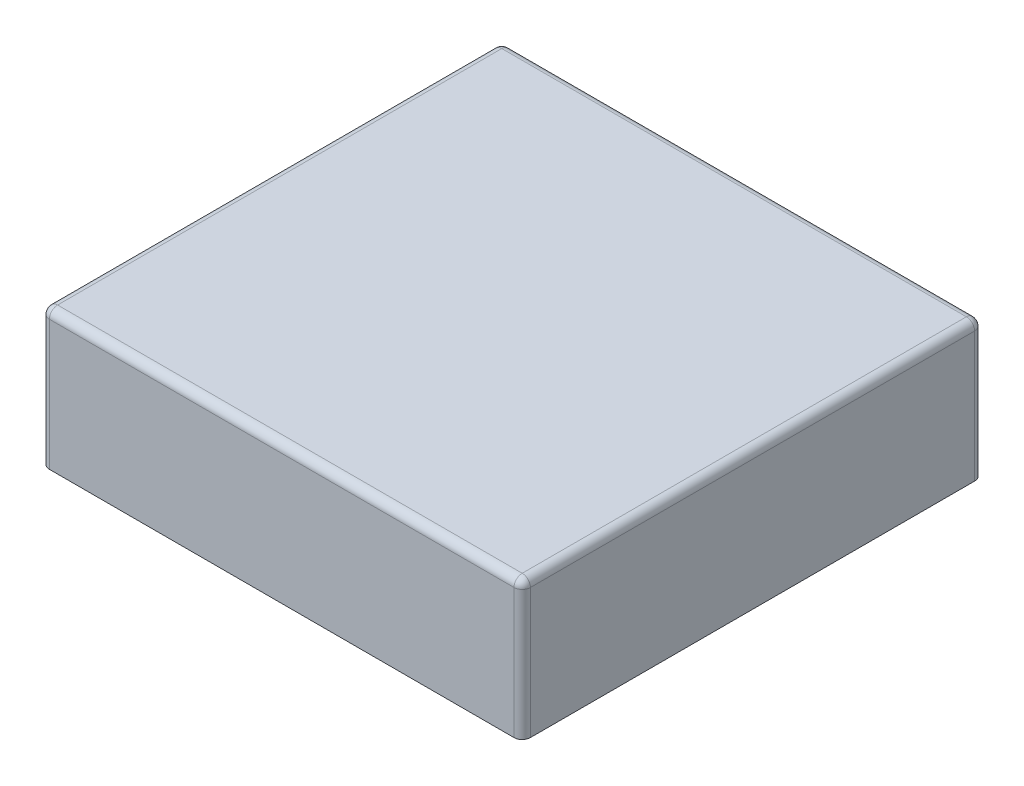
ISO-10303-21;
HEADER;
FILE_DESCRIPTION(('STEP AP214'),'2;1');
FILE_NAME('part.step','',(''),(''),'','','');
FILE_SCHEMA(('AUTOMOTIVE_DESIGN { 1 0 10303 214 1 1 1 1 }'));
ENDSEC;
DATA;
#1=APPLICATION_CONTEXT('core data for automotive mechanical design processes');
#2=APPLICATION_PROTOCOL_DEFINITION('international standard','automotive_design',2000,#1);
#3=PRODUCT_CONTEXT('',#1,'mechanical');
#4=PRODUCT('Part','Part','',(#3));
#5=PRODUCT_RELATED_PRODUCT_CATEGORY('part','',(#4));
#6=PRODUCT_DEFINITION_FORMATION('','',#4);
#7=PRODUCT_DEFINITION_CONTEXT('part definition',#1,'design');
#8=PRODUCT_DEFINITION('design','',#6,#7);
#9=PRODUCT_DEFINITION_SHAPE('','',#8);
#10=(LENGTH_UNIT() NAMED_UNIT(*) SI_UNIT(.MILLI.,.METRE.));
#11=(NAMED_UNIT(*) PLANE_ANGLE_UNIT() SI_UNIT($,.RADIAN.));
#12=(NAMED_UNIT(*) SI_UNIT($,.STERADIAN.) SOLID_ANGLE_UNIT());
#13=UNCERTAINTY_MEASURE_WITH_UNIT(LENGTH_MEASURE(1.E-05),#10,'distance_accuracy_value','');
#14=(GEOMETRIC_REPRESENTATION_CONTEXT(3) GLOBAL_UNCERTAINTY_ASSIGNED_CONTEXT((#13)) GLOBAL_UNIT_ASSIGNED_CONTEXT((#10,
#11,#12)) REPRESENTATION_CONTEXT('',''));
#15=CARTESIAN_POINT('',(0.,0.,0.));
#16=DIRECTION('',(0.,0.,1.));
#17=DIRECTION('',(1.,0.,0.));
#18=AXIS2_PLACEMENT_3D('',#15,#16,#17);
#19=CARTESIAN_POINT('',(58.5549999999999,33.65,-56.0700000000002));
#20=DIRECTION('',(-1.,0.,0.));
#21=DIRECTION('',(0.,0.,1.));
#22=AXIS2_PLACEMENT_3D('',#19,#20,#21);
#23=PLANE('',#22);
#24=DIRECTION('',(0.,0.,-1.));
#25=VECTOR('',#24,1.);
#26=CARTESIAN_POINT('',(58.5549999999999,0.,-56.0700000000002));
#27=LINE('',#26,#25);
#28=CARTESIAN_POINT('',(58.5549999999999,0.,54.07));
#29=VERTEX_POINT('',#28);
#30=CARTESIAN_POINT('',(58.5549999999999,0.,-54.0700000000002));
#31=VERTEX_POINT('',#30);
#32=EDGE_CURVE('E153',#29,#31,#27,.T.);
#33=ORIENTED_EDGE('',*,*,#32,.T.);
#34=DIRECTION('',(0.,-1.,0.));
#35=VECTOR('',#34,1.);
#36=CARTESIAN_POINT('',(58.5549999999999,33.65,-54.0700000000002));
#37=LINE('',#36,#35);
#38=CARTESIAN_POINT('',(58.5549999999999,31.65,-54.0700000000002));
#39=VERTEX_POINT('',#38);
#40=EDGE_CURVE('E181',#31,#39,#37,.F.);
#41=ORIENTED_EDGE('',*,*,#40,.T.);
#42=DIRECTION('',(0.,0.,-1.));
#43=VECTOR('',#42,1.);
#44=CARTESIAN_POINT('',(58.5549999999999,31.65,56.07));
#45=LINE('',#44,#43);
#46=CARTESIAN_POINT('',(58.5549999999999,31.65,54.07));
#47=VERTEX_POINT('',#46);
#48=EDGE_CURVE('E177',#39,#47,#45,.F.);
#49=ORIENTED_EDGE('',*,*,#48,.T.);
#50=DIRECTION('',(0.,-1.,0.));
#51=VECTOR('',#50,1.);
#52=CARTESIAN_POINT('',(58.5549999999999,33.65,54.07));
#53=LINE('',#52,#51);
#54=EDGE_CURVE('E179',#47,#29,#53,.T.);
#55=ORIENTED_EDGE('',*,*,#54,.T.);
#56=EDGE_LOOP('',(#33,#41,#49,#55));
#57=FACE_BOUND('',#56,.T.);
#58=ADVANCED_FACE('F39',(#57),#23,.F.);
#59=CARTESIAN_POINT('',(-58.5550000000001,33.65,-56.0700000000002));
#60=DIRECTION('',(0.,0.,1.));
#61=DIRECTION('',(1.,0.,0.));
#62=AXIS2_PLACEMENT_3D('',#59,#60,#61);
#63=PLANE('',#62);
#64=DIRECTION('',(-1.,0.,0.));
#65=VECTOR('',#64,1.);
#66=CARTESIAN_POINT('',(-58.5550000000001,0.,-56.0700000000002));
#67=LINE('',#66,#65);
#68=CARTESIAN_POINT('',(56.5549999999999,0.,-56.0700000000002));
#69=VERTEX_POINT('',#68);
#70=CARTESIAN_POINT('',(-56.5550000000001,0.,-56.0700000000002));
#71=VERTEX_POINT('',#70);
#72=EDGE_CURVE('E148',#69,#71,#67,.T.);
#73=ORIENTED_EDGE('',*,*,#72,.T.);
#74=DIRECTION('',(0.,-1.,0.));
#75=VECTOR('',#74,1.);
#76=CARTESIAN_POINT('',(-56.5550000000001,33.65,-56.0700000000002));
#77=LINE('',#76,#75);
#78=CARTESIAN_POINT('',(-56.5550000000001,31.65,-56.0700000000002));
#79=VERTEX_POINT('',#78);
#80=EDGE_CURVE('E125',#71,#79,#77,.F.);
#81=ORIENTED_EDGE('',*,*,#80,.T.);
#82=DIRECTION('',(-1.,0.,0.));
#83=VECTOR('',#82,1.);
#84=CARTESIAN_POINT('',(58.5549999999999,31.65,-56.0700000000002));
#85=LINE('',#84,#83);
#86=CARTESIAN_POINT('',(56.5549999999999,31.65,-56.0700000000002));
#87=VERTEX_POINT('',#86);
#88=EDGE_CURVE('E130',#79,#87,#85,.F.);
#89=ORIENTED_EDGE('',*,*,#88,.T.);
#90=DIRECTION('',(0.,-1.,0.));
#91=VECTOR('',#90,1.);
#92=CARTESIAN_POINT('',(56.5549999999999,33.65,-56.0700000000002));
#93=LINE('',#92,#91);
#94=EDGE_CURVE('E174',#87,#69,#93,.T.);
#95=ORIENTED_EDGE('',*,*,#94,.T.);
#96=EDGE_LOOP('',(#73,#81,#89,#95));
#97=FACE_BOUND('',#96,.T.);
#98=ADVANCED_FACE('F281',(#97),#63,.F.);
#99=CARTESIAN_POINT('',(-58.5550000000001,33.65,-56.0700000000002));
#100=DIRECTION('',(1.,0.,0.));
#101=DIRECTION('',(0.,0.,-1.));
#102=AXIS2_PLACEMENT_3D('',#99,#100,#101);
#103=PLANE('',#102);
#104=DIRECTION('',(0.,0.,1.));
#105=VECTOR('',#104,1.);
#106=CARTESIAN_POINT('',(-58.5550000000001,31.65,-56.0700000000002));
#107=LINE('',#106,#105);
#108=CARTESIAN_POINT('',(-58.5550000000001,31.65,54.07));
#109=VERTEX_POINT('',#108);
#110=CARTESIAN_POINT('',(-58.5550000000001,31.65,-54.0700000000002));
#111=VERTEX_POINT('',#110);
#112=EDGE_CURVE('E139',#109,#111,#107,.F.);
#113=ORIENTED_EDGE('',*,*,#112,.T.);
#114=DIRECTION('',(0.,-1.,0.));
#115=VECTOR('',#114,1.);
#116=CARTESIAN_POINT('',(-58.5550000000001,33.65,-54.0700000000002));
#117=LINE('',#116,#115);
#118=CARTESIAN_POINT('',(-58.5550000000001,0.,-54.0700000000002));
#119=VERTEX_POINT('',#118);
#120=EDGE_CURVE('E124',#111,#119,#117,.T.);
#121=ORIENTED_EDGE('',*,*,#120,.T.);
#122=DIRECTION('',(0.,0.,1.));
#123=VECTOR('',#122,1.);
#124=CARTESIAN_POINT('',(-58.5550000000001,0.,-56.0700000000002));
#125=LINE('',#124,#123);
#126=CARTESIAN_POINT('',(-58.5550000000001,0.,54.07));
#127=VERTEX_POINT('',#126);
#128=EDGE_CURVE('E136',#119,#127,#125,.T.);
#129=ORIENTED_EDGE('',*,*,#128,.T.);
#130=DIRECTION('',(0.,-1.,0.));
#131=VECTOR('',#130,1.);
#132=CARTESIAN_POINT('',(-58.5550000000001,33.65,54.07));
#133=LINE('',#132,#131);
#134=EDGE_CURVE('E141',#127,#109,#133,.F.);
#135=ORIENTED_EDGE('',*,*,#134,.T.);
#136=EDGE_LOOP('',(#113,#121,#129,#135));
#137=FACE_BOUND('',#136,.T.);
#138=ADVANCED_FACE('F135',(#137),#103,.F.);
#139=CARTESIAN_POINT('',(-58.5550000000001,33.65,56.07));
#140=DIRECTION('',(0.,0.,-1.));
#141=DIRECTION('',(-1.,0.,0.));
#142=AXIS2_PLACEMENT_3D('',#139,#140,#141);
#143=PLANE('',#142);
#144=DIRECTION('',(1.,0.,0.));
#145=VECTOR('',#144,1.);
#146=CARTESIAN_POINT('',(-58.5550000000001,31.65,56.07));
#147=LINE('',#146,#145);
#148=CARTESIAN_POINT('',(56.5549999999999,31.65,56.07));
#149=VERTEX_POINT('',#148);
#150=CARTESIAN_POINT('',(-56.5550000000001,31.65,56.07));
#151=VERTEX_POINT('',#150);
#152=EDGE_CURVE('E183',#149,#151,#147,.F.);
#153=ORIENTED_EDGE('',*,*,#152,.T.);
#154=DIRECTION('',(0.,-1.,0.));
#155=VECTOR('',#154,1.);
#156=CARTESIAN_POINT('',(-56.5550000000001,33.65,56.07));
#157=LINE('',#156,#155);
#158=CARTESIAN_POINT('',(-56.5550000000001,0.,56.07));
#159=VERTEX_POINT('',#158);
#160=EDGE_CURVE('E187',#151,#159,#157,.T.);
#161=ORIENTED_EDGE('',*,*,#160,.T.);
#162=DIRECTION('',(1.,0.,0.));
#163=VECTOR('',#162,1.);
#164=CARTESIAN_POINT('',(-58.5550000000001,0.,56.07));
#165=LINE('',#164,#163);
#166=CARTESIAN_POINT('',(56.5549999999999,0.,56.07));
#167=VERTEX_POINT('',#166);
#168=EDGE_CURVE('E147',#159,#167,#165,.T.);
#169=ORIENTED_EDGE('',*,*,#168,.T.);
#170=DIRECTION('',(0.,-1.,0.));
#171=VECTOR('',#170,1.);
#172=CARTESIAN_POINT('',(56.5549999999999,33.65,56.07));
#173=LINE('',#172,#171);
#174=EDGE_CURVE('E185',#167,#149,#173,.F.);
#175=ORIENTED_EDGE('',*,*,#174,.T.);
#176=EDGE_LOOP('',(#153,#161,#169,#175));
#177=FACE_BOUND('',#176,.T.);
#178=ADVANCED_FACE('F260',(#177),#143,.F.);
#179=CARTESIAN_POINT('',(0.,33.65,0.));
#180=DIRECTION('',(0.,1.,0.));
#181=DIRECTION('',(0.,0.,1.));
#182=AXIS2_PLACEMENT_3D('',#179,#180,#181);
#183=PLANE('',#182);
#184=DIRECTION('',(0.,0.,-1.));
#185=VECTOR('',#184,1.);
#186=CARTESIAN_POINT('',(56.5549999999999,33.65,-56.0700000000002));
#187=LINE('',#186,#185);
#188=CARTESIAN_POINT('',(56.5549999999999,33.65,54.07));
#189=VERTEX_POINT('',#188);
#190=CARTESIAN_POINT('',(56.5549999999999,33.65,-54.0700000000002));
#191=VERTEX_POINT('',#190);
#192=EDGE_CURVE('E63',#189,#191,#187,.T.);
#193=ORIENTED_EDGE('',*,*,#192,.T.);
#194=DIRECTION('',(-1.,0.,0.));
#195=VECTOR('',#194,1.);
#196=CARTESIAN_POINT('',(-58.5550000000001,33.65,-54.0700000000002));
#197=LINE('',#196,#195);
#198=CARTESIAN_POINT('',(-56.5550000000001,33.65,-54.0700000000002));
#199=VERTEX_POINT('',#198);
#200=EDGE_CURVE('E11',#191,#199,#197,.T.);
#201=ORIENTED_EDGE('',*,*,#200,.T.);
#202=DIRECTION('',(0.,0.,1.));
#203=VECTOR('',#202,1.);
#204=CARTESIAN_POINT('',(-56.5550000000001,33.65,56.07));
#205=LINE('',#204,#203);
#206=CARTESIAN_POINT('',(-56.5550000000001,33.65,54.07));
#207=VERTEX_POINT('',#206);
#208=EDGE_CURVE('E48',#199,#207,#205,.T.);
#209=ORIENTED_EDGE('',*,*,#208,.T.);
#210=DIRECTION('',(1.,0.,0.));
#211=VECTOR('',#210,1.);
#212=CARTESIAN_POINT('',(58.5549999999999,33.65,54.07));
#213=LINE('',#212,#211);
#214=EDGE_CURVE('E189',#207,#189,#213,.T.);
#215=ORIENTED_EDGE('',*,*,#214,.T.);
#216=EDGE_LOOP('',(#193,#201,#209,#215));
#217=FACE_BOUND('',#216,.T.);
#218=ADVANCED_FACE('F352',(#217),#183,.T.);
#219=CARTESIAN_POINT('',(0.,0.,0.));
#220=DIRECTION('',(0.,1.,0.));
#221=DIRECTION('',(0.,0.,1.));
#222=AXIS2_PLACEMENT_3D('',#219,#220,#221);
#223=PLANE('',#222);
#224=CARTESIAN_POINT('',(-47.,0.,-46.));
#225=DIRECTION('',(0.,1.,0.));
#226=DIRECTION('',(0.,0.,1.));
#227=AXIS2_PLACEMENT_3D('',#224,#225,#226);
#228=CIRCLE('',#227,5.);
#229=CARTESIAN_POINT('',(-47.,0.,-41.));
#230=VERTEX_POINT('',#229);
#231=EDGE_CURVE('E165',#230,#230,#228,.F.);
#232=ORIENTED_EDGE('',*,*,#231,.F.);
#233=EDGE_LOOP('',(#232));
#234=FACE_BOUND('',#233,.T.);
#235=CARTESIAN_POINT('',(47.,0.,-46.));
#236=DIRECTION('',(0.,1.,0.));
#237=DIRECTION('',(0.,0.,1.));
#238=AXIS2_PLACEMENT_3D('',#235,#236,#237);
#239=CIRCLE('',#238,5.);
#240=CARTESIAN_POINT('',(47.,0.,-41.));
#241=VERTEX_POINT('',#240);
#242=EDGE_CURVE('E162',#241,#241,#239,.F.);
#243=ORIENTED_EDGE('',*,*,#242,.F.);
#244=EDGE_LOOP('',(#243));
#245=FACE_BOUND('',#244,.T.);
#246=CARTESIAN_POINT('',(47.,0.,46.));
#247=DIRECTION('',(0.,1.,0.));
#248=DIRECTION('',(0.,0.,1.));
#249=AXIS2_PLACEMENT_3D('',#246,#247,#248);
#250=CIRCLE('',#249,5.);
#251=CARTESIAN_POINT('',(47.,0.,51.));
#252=VERTEX_POINT('',#251);
#253=EDGE_CURVE('E159',#252,#252,#250,.F.);
#254=ORIENTED_EDGE('',*,*,#253,.F.);
#255=EDGE_LOOP('',(#254));
#256=FACE_BOUND('',#255,.T.);
#257=CARTESIAN_POINT('',(-47.,0.,46.));
#258=DIRECTION('',(0.,1.,0.));
#259=DIRECTION('',(0.,0.,1.));
#260=AXIS2_PLACEMENT_3D('',#257,#258,#259);
#261=CIRCLE('',#260,5.);
#262=CARTESIAN_POINT('',(-47.,0.,51.));
#263=VERTEX_POINT('',#262);
#264=EDGE_CURVE('E151',#263,#263,#261,.F.);
#265=ORIENTED_EDGE('',*,*,#264,.F.);
#266=EDGE_LOOP('',(#265));
#267=FACE_BOUND('',#266,.T.);
#268=ORIENTED_EDGE('',*,*,#128,.F.);
#269=CARTESIAN_POINT('',(-56.5550000000001,0.,-54.0700000000002));
#270=DIRECTION('',(0.,1.,0.));
#271=DIRECTION('',(0.,0.,1.));
#272=AXIS2_PLACEMENT_3D('',#269,#270,#271);
#273=CIRCLE('',#272,2.);
#274=EDGE_CURVE('E120',#119,#71,#273,.F.);
#275=ORIENTED_EDGE('',*,*,#274,.T.);
#276=ORIENTED_EDGE('',*,*,#72,.F.);
#277=CARTESIAN_POINT('',(56.5549999999999,0.,-54.0700000000002));
#278=DIRECTION('',(0.,1.,0.));
#279=DIRECTION('',(0.,0.,1.));
#280=AXIS2_PLACEMENT_3D('',#277,#278,#279);
#281=CIRCLE('',#280,2.);
#282=EDGE_CURVE('E131',#69,#31,#281,.F.);
#283=ORIENTED_EDGE('',*,*,#282,.T.);
#284=ORIENTED_EDGE('',*,*,#32,.F.);
#285=CARTESIAN_POINT('',(56.5549999999999,0.,54.07));
#286=DIRECTION('',(0.,1.,0.));
#287=DIRECTION('',(0.,0.,1.));
#288=AXIS2_PLACEMENT_3D('',#285,#286,#287);
#289=CIRCLE('',#288,2.);
#290=EDGE_CURVE('E140',#29,#167,#289,.F.);
#291=ORIENTED_EDGE('',*,*,#290,.T.);
#292=ORIENTED_EDGE('',*,*,#168,.F.);
#293=CARTESIAN_POINT('',(-56.5550000000001,0.,54.07));
#294=DIRECTION('',(0.,1.,0.));
#295=DIRECTION('',(0.,0.,1.));
#296=AXIS2_PLACEMENT_3D('',#293,#294,#295);
#297=CIRCLE('',#296,2.);
#298=EDGE_CURVE('E146',#159,#127,#297,.F.);
#299=ORIENTED_EDGE('',*,*,#298,.T.);
#300=EDGE_LOOP('',(#268,#275,#276,#283,#284,#291,#292,#299));
#301=FACE_BOUND('',#300,.T.);
#302=ADVANCED_FACE('F143',(#234,#245,#256,#267,#301),#223,.F.);
#303=CARTESIAN_POINT('',(-47.,-3.,46.));
#304=DIRECTION('',(0.,1.,0.));
#305=DIRECTION('',(0.,0.,1.));
#306=AXIS2_PLACEMENT_3D('',#303,#304,#305);
#307=CYLINDRICAL_SURFACE('',#306,5.);
#308=CARTESIAN_POINT('',(-47.,-3.,46.));
#309=DIRECTION('',(0.,-1.,0.));
#310=DIRECTION('',(0.,0.,-1.));
#311=AXIS2_PLACEMENT_3D('',#308,#309,#310);
#312=CIRCLE('',#311,5.);
#313=CARTESIAN_POINT('',(-47.,-3.,41.));
#314=VERTEX_POINT('',#313);
#315=EDGE_CURVE('E239',#314,#314,#312,.T.);
#316=ORIENTED_EDGE('',*,*,#315,.F.);
#317=EDGE_LOOP('',(#316));
#318=FACE_BOUND('',#317,.T.);
#319=ORIENTED_EDGE('',*,*,#264,.T.);
#320=EDGE_LOOP('',(#319));
#321=FACE_BOUND('',#320,.T.);
#322=ADVANCED_FACE('F347',(#318,#321),#307,.T.);
#323=CARTESIAN_POINT('',(-47.,-3.,46.));
#324=DIRECTION('',(0.,-1.,0.));
#325=DIRECTION('',(0.,0.,-1.));
#326=AXIS2_PLACEMENT_3D('',#323,#324,#325);
#327=PLANE('',#326);
#328=ORIENTED_EDGE('',*,*,#315,.T.);
#329=EDGE_LOOP('',(#328));
#330=FACE_BOUND('',#329,.T.);
#331=ADVANCED_FACE('F343',(#330),#327,.T.);
#332=CARTESIAN_POINT('',(47.,-3.,46.));
#333=DIRECTION('',(0.,1.,0.));
#334=DIRECTION('',(0.,0.,1.));
#335=AXIS2_PLACEMENT_3D('',#332,#333,#334);
#336=CYLINDRICAL_SURFACE('',#335,5.);
#337=CARTESIAN_POINT('',(47.,-3.,46.));
#338=DIRECTION('',(0.,-1.,0.));
#339=DIRECTION('',(0.,0.,-1.));
#340=AXIS2_PLACEMENT_3D('',#337,#338,#339);
#341=CIRCLE('',#340,5.);
#342=CARTESIAN_POINT('',(47.,-3.,41.));
#343=VERTEX_POINT('',#342);
#344=EDGE_CURVE('E234',#343,#343,#341,.T.);
#345=ORIENTED_EDGE('',*,*,#344,.F.);
#346=EDGE_LOOP('',(#345));
#347=FACE_BOUND('',#346,.T.);
#348=ORIENTED_EDGE('',*,*,#253,.T.);
#349=EDGE_LOOP('',(#348));
#350=FACE_BOUND('',#349,.T.);
#351=ADVANCED_FACE('F339',(#347,#350),#336,.T.);
#352=CARTESIAN_POINT('',(47.,-3.,46.));
#353=DIRECTION('',(0.,-1.,0.));
#354=DIRECTION('',(0.,0.,-1.));
#355=AXIS2_PLACEMENT_3D('',#352,#353,#354);
#356=PLANE('',#355);
#357=ORIENTED_EDGE('',*,*,#344,.T.);
#358=EDGE_LOOP('',(#357));
#359=FACE_BOUND('',#358,.T.);
#360=ADVANCED_FACE('F335',(#359),#356,.T.);
#361=CARTESIAN_POINT('',(47.,-3.,-46.));
#362=DIRECTION('',(0.,1.,0.));
#363=DIRECTION('',(0.,0.,1.));
#364=AXIS2_PLACEMENT_3D('',#361,#362,#363);
#365=CYLINDRICAL_SURFACE('',#364,5.);
#366=CARTESIAN_POINT('',(47.,-3.,-46.));
#367=DIRECTION('',(0.,-1.,0.));
#368=DIRECTION('',(0.,0.,-1.));
#369=AXIS2_PLACEMENT_3D('',#366,#367,#368);
#370=CIRCLE('',#369,5.);
#371=CARTESIAN_POINT('',(47.,-3.,-51.));
#372=VERTEX_POINT('',#371);
#373=EDGE_CURVE('E229',#372,#372,#370,.T.);
#374=ORIENTED_EDGE('',*,*,#373,.F.);
#375=EDGE_LOOP('',(#374));
#376=FACE_BOUND('',#375,.T.);
#377=ORIENTED_EDGE('',*,*,#242,.T.);
#378=EDGE_LOOP('',(#377));
#379=FACE_BOUND('',#378,.T.);
#380=ADVANCED_FACE('F331',(#376,#379),#365,.T.);
#381=CARTESIAN_POINT('',(47.,-3.,-46.));
#382=DIRECTION('',(0.,-1.,0.));
#383=DIRECTION('',(0.,0.,-1.));
#384=AXIS2_PLACEMENT_3D('',#381,#382,#383);
#385=PLANE('',#384);
#386=ORIENTED_EDGE('',*,*,#373,.T.);
#387=EDGE_LOOP('',(#386));
#388=FACE_BOUND('',#387,.T.);
#389=ADVANCED_FACE('F325',(#388),#385,.T.);
#390=CARTESIAN_POINT('',(-47.,-3.,-46.));
#391=DIRECTION('',(0.,1.,0.));
#392=DIRECTION('',(0.,0.,1.));
#393=AXIS2_PLACEMENT_3D('',#390,#391,#392);
#394=CYLINDRICAL_SURFACE('',#393,5.);
#395=CARTESIAN_POINT('',(-47.,-3.,-46.));
#396=DIRECTION('',(0.,-1.,0.));
#397=DIRECTION('',(0.,0.,-1.));
#398=AXIS2_PLACEMENT_3D('',#395,#396,#397);
#399=CIRCLE('',#398,5.);
#400=CARTESIAN_POINT('',(-47.,-3.,-51.));
#401=VERTEX_POINT('',#400);
#402=EDGE_CURVE('E224',#401,#401,#399,.T.);
#403=ORIENTED_EDGE('',*,*,#402,.F.);
#404=EDGE_LOOP('',(#403));
#405=FACE_BOUND('',#404,.T.);
#406=ORIENTED_EDGE('',*,*,#231,.T.);
#407=EDGE_LOOP('',(#406));
#408=FACE_BOUND('',#407,.T.);
#409=ADVANCED_FACE('F320',(#405,#408),#394,.T.);
#410=CARTESIAN_POINT('',(-47.,-3.,-46.));
#411=DIRECTION('',(0.,-1.,0.));
#412=DIRECTION('',(0.,0.,-1.));
#413=AXIS2_PLACEMENT_3D('',#410,#411,#412);
#414=PLANE('',#413);
#415=ORIENTED_EDGE('',*,*,#402,.T.);
#416=EDGE_LOOP('',(#415));
#417=FACE_BOUND('',#416,.T.);
#418=ADVANCED_FACE('F316',(#417),#414,.T.);
#419=CARTESIAN_POINT('',(56.5549999999999,33.65,54.07));
#420=DIRECTION('',(0.,-1.,0.));
#421=DIRECTION('',(0.,0.,-1.));
#422=AXIS2_PLACEMENT_3D('',#419,#420,#421);
#423=CYLINDRICAL_SURFACE('',#422,2.);
#424=CARTESIAN_POINT('',(56.5549999999999,31.65,54.07));
#425=DIRECTION('',(0.,1.,0.));
#426=DIRECTION('',(0.,0.,1.));
#427=AXIS2_PLACEMENT_3D('',#424,#425,#426);
#428=CIRCLE('',#427,2.);
#429=EDGE_CURVE('E43',#149,#47,#428,.T.);
#430=ORIENTED_EDGE('',*,*,#429,.F.);
#431=ORIENTED_EDGE('',*,*,#174,.F.);
#432=ORIENTED_EDGE('',*,*,#290,.F.);
#433=ORIENTED_EDGE('',*,*,#54,.F.);
#434=EDGE_LOOP('',(#430,#431,#432,#433));
#435=FACE_BOUND('',#434,.T.);
#436=ADVANCED_FACE('F41',(#435),#423,.T.);
#437=CARTESIAN_POINT('',(56.5549999999999,31.65,54.07));
#438=DIRECTION('',(1.,0.,0.));
#439=DIRECTION('',(0.,0.,-1.));
#440=AXIS2_PLACEMENT_3D('',#437,#438,#439);
#441=SPHERICAL_SURFACE('',#440,2.);
#442=CARTESIAN_POINT('',(56.5549999999999,31.65,54.07));
#443=DIRECTION('',(1.,0.,0.));
#444=DIRECTION('',(0.,0.,-1.));
#445=AXIS2_PLACEMENT_3D('',#442,#443,#444);
#446=CIRCLE('',#445,2.);
#447=EDGE_CURVE('E216',#149,#189,#446,.F.);
#448=ORIENTED_EDGE('',*,*,#447,.F.);
#449=ORIENTED_EDGE('',*,*,#429,.T.);
#450=CARTESIAN_POINT('',(56.5549999999999,31.65,54.07));
#451=DIRECTION('',(0.,0.,1.));
#452=DIRECTION('',(1.,0.,0.));
#453=AXIS2_PLACEMENT_3D('',#450,#451,#452);
#454=CIRCLE('',#453,2.);
#455=EDGE_CURVE('E218',#189,#47,#454,.F.);
#456=ORIENTED_EDGE('',*,*,#455,.F.);
#457=EDGE_LOOP('',(#448,#449,#456));
#458=FACE_BOUND('',#457,.T.);
#459=ADVANCED_FACE('F311',(#458),#441,.T.);
#460=CARTESIAN_POINT('',(56.5549999999999,33.65,-54.0700000000002));
#461=DIRECTION('',(0.,-1.,0.));
#462=DIRECTION('',(0.,0.,-1.));
#463=AXIS2_PLACEMENT_3D('',#460,#461,#462);
#464=CYLINDRICAL_SURFACE('',#463,2.);
#465=ORIENTED_EDGE('',*,*,#282,.F.);
#466=ORIENTED_EDGE('',*,*,#94,.F.);
#467=CARTESIAN_POINT('',(56.5549999999999,31.65,-54.0700000000002));
#468=DIRECTION('',(0.,1.,0.));
#469=DIRECTION('',(0.,0.,1.));
#470=AXIS2_PLACEMENT_3D('',#467,#468,#469);
#471=CIRCLE('',#470,2.);
#472=EDGE_CURVE('E213',#39,#87,#471,.T.);
#473=ORIENTED_EDGE('',*,*,#472,.F.);
#474=ORIENTED_EDGE('',*,*,#40,.F.);
#475=EDGE_LOOP('',(#465,#466,#473,#474));
#476=FACE_BOUND('',#475,.T.);
#477=ADVANCED_FACE('F250',(#476),#464,.T.);
#478=CARTESIAN_POINT('',(56.5549999999999,31.65,0.));
#479=DIRECTION('',(0.,0.,1.));
#480=DIRECTION('',(1.,0.,0.));
#481=AXIS2_PLACEMENT_3D('',#478,#479,#480);
#482=CYLINDRICAL_SURFACE('',#481,2.);
#483=ORIENTED_EDGE('',*,*,#455,.T.);
#484=ORIENTED_EDGE('',*,*,#48,.F.);
#485=CARTESIAN_POINT('',(56.5549999999999,31.65,-54.0700000000002));
#486=DIRECTION('',(0.,0.,-1.));
#487=DIRECTION('',(-1.,0.,0.));
#488=AXIS2_PLACEMENT_3D('',#485,#486,#487);
#489=CIRCLE('',#488,2.);
#490=EDGE_CURVE('E210',#191,#39,#489,.T.);
#491=ORIENTED_EDGE('',*,*,#490,.F.);
#492=ORIENTED_EDGE('',*,*,#192,.F.);
#493=EDGE_LOOP('',(#483,#484,#491,#492));
#494=FACE_BOUND('',#493,.T.);
#495=ADVANCED_FACE('F256',(#494),#482,.T.);
#496=CARTESIAN_POINT('',(0.,31.65,54.07));
#497=DIRECTION('',(-1.,0.,0.));
#498=DIRECTION('',(0.,0.,1.));
#499=AXIS2_PLACEMENT_3D('',#496,#497,#498);
#500=CYLINDRICAL_SURFACE('',#499,2.);
#501=ORIENTED_EDGE('',*,*,#447,.T.);
#502=ORIENTED_EDGE('',*,*,#214,.F.);
#503=CARTESIAN_POINT('',(-56.5550000000001,31.65,54.07));
#504=DIRECTION('',(-1.,0.,0.));
#505=DIRECTION('',(0.,0.,1.));
#506=AXIS2_PLACEMENT_3D('',#503,#504,#505);
#507=CIRCLE('',#506,2.);
#508=EDGE_CURVE('E207',#151,#207,#507,.T.);
#509=ORIENTED_EDGE('',*,*,#508,.F.);
#510=ORIENTED_EDGE('',*,*,#152,.F.);
#511=EDGE_LOOP('',(#501,#502,#509,#510));
#512=FACE_BOUND('',#511,.T.);
#513=ADVANCED_FACE('F270',(#512),#500,.T.);
#514=CARTESIAN_POINT('',(-56.5550000000001,33.65,54.07));
#515=DIRECTION('',(0.,-1.,0.));
#516=DIRECTION('',(0.,0.,-1.));
#517=AXIS2_PLACEMENT_3D('',#514,#515,#516);
#518=CYLINDRICAL_SURFACE('',#517,2.);
#519=ORIENTED_EDGE('',*,*,#298,.F.);
#520=ORIENTED_EDGE('',*,*,#160,.F.);
#521=CARTESIAN_POINT('',(-56.5550000000001,31.65,54.07));
#522=DIRECTION('',(0.,1.,0.));
#523=DIRECTION('',(0.,0.,1.));
#524=AXIS2_PLACEMENT_3D('',#521,#522,#523);
#525=CIRCLE('',#524,2.);
#526=EDGE_CURVE('E204',#109,#151,#525,.T.);
#527=ORIENTED_EDGE('',*,*,#526,.F.);
#528=ORIENTED_EDGE('',*,*,#134,.F.);
#529=EDGE_LOOP('',(#519,#520,#527,#528));
#530=FACE_BOUND('',#529,.T.);
#531=ADVANCED_FACE('F266',(#530),#518,.T.);
#532=CARTESIAN_POINT('',(56.5549999999999,31.65,-54.0700000000002));
#533=DIRECTION('',(1.,0.,0.));
#534=DIRECTION('',(0.,0.,-1.));
#535=AXIS2_PLACEMENT_3D('',#532,#533,#534);
#536=SPHERICAL_SURFACE('',#535,2.);
#537=ORIENTED_EDGE('',*,*,#490,.T.);
#538=ORIENTED_EDGE('',*,*,#472,.T.);
#539=CARTESIAN_POINT('',(56.5549999999999,31.65,-54.0700000000002));
#540=DIRECTION('',(1.,0.,0.));
#541=DIRECTION('',(0.,1.,0.));
#542=AXIS2_PLACEMENT_3D('',#539,#540,#541);
#543=CIRCLE('',#542,2.);
#544=EDGE_CURVE('E201',#191,#87,#543,.F.);
#545=ORIENTED_EDGE('',*,*,#544,.F.);
#546=EDGE_LOOP('',(#537,#538,#545));
#547=FACE_BOUND('',#546,.T.);
#548=ADVANCED_FACE('F254',(#547),#536,.T.);
#549=CARTESIAN_POINT('',(-56.5550000000001,31.65,54.07));
#550=DIRECTION('',(0.,0.,1.));
#551=DIRECTION('',(1.,0.,0.));
#552=AXIS2_PLACEMENT_3D('',#549,#550,#551);
#553=SPHERICAL_SURFACE('',#552,2.);
#554=ORIENTED_EDGE('',*,*,#526,.T.);
#555=ORIENTED_EDGE('',*,*,#508,.T.);
#556=CARTESIAN_POINT('',(-56.5550000000001,31.65,54.07));
#557=DIRECTION('',(0.,0.,1.));
#558=DIRECTION('',(1.,0.,0.));
#559=AXIS2_PLACEMENT_3D('',#556,#557,#558);
#560=CIRCLE('',#559,2.);
#561=EDGE_CURVE('E198',#109,#207,#560,.F.);
#562=ORIENTED_EDGE('',*,*,#561,.F.);
#563=EDGE_LOOP('',(#554,#555,#562));
#564=FACE_BOUND('',#563,.T.);
#565=ADVANCED_FACE('F272',(#564),#553,.T.);
#566=CARTESIAN_POINT('',(0.,31.65,-54.0700000000002));
#567=DIRECTION('',(1.,0.,0.));
#568=DIRECTION('',(0.,0.,-1.));
#569=AXIS2_PLACEMENT_3D('',#566,#567,#568);
#570=CYLINDRICAL_SURFACE('',#569,2.);
#571=ORIENTED_EDGE('',*,*,#544,.T.);
#572=ORIENTED_EDGE('',*,*,#88,.F.);
#573=CARTESIAN_POINT('',(-56.5550000000001,31.65,-54.0700000000002));
#574=DIRECTION('',(-1.,0.,0.));
#575=DIRECTION('',(0.,0.,1.));
#576=AXIS2_PLACEMENT_3D('',#573,#574,#575);
#577=CIRCLE('',#576,2.);
#578=EDGE_CURVE('E196',#199,#79,#577,.T.);
#579=ORIENTED_EDGE('',*,*,#578,.F.);
#580=ORIENTED_EDGE('',*,*,#200,.F.);
#581=EDGE_LOOP('',(#571,#572,#579,#580));
#582=FACE_BOUND('',#581,.T.);
#583=ADVANCED_FACE('F279',(#582),#570,.T.);
#584=CARTESIAN_POINT('',(-56.5550000000001,31.65,0.));
#585=DIRECTION('',(0.,0.,-1.));
#586=DIRECTION('',(-1.,0.,0.));
#587=AXIS2_PLACEMENT_3D('',#584,#585,#586);
#588=CYLINDRICAL_SURFACE('',#587,2.);
#589=ORIENTED_EDGE('',*,*,#561,.T.);
#590=ORIENTED_EDGE('',*,*,#208,.F.);
#591=CARTESIAN_POINT('',(-56.5550000000001,31.65,-54.0700000000002));
#592=DIRECTION('',(0.,0.,-1.));
#593=DIRECTION('',(-1.,0.,0.));
#594=AXIS2_PLACEMENT_3D('',#591,#592,#593);
#595=CIRCLE('',#594,2.);
#596=EDGE_CURVE('E56',#111,#199,#595,.T.);
#597=ORIENTED_EDGE('',*,*,#596,.F.);
#598=ORIENTED_EDGE('',*,*,#112,.F.);
#599=EDGE_LOOP('',(#589,#590,#597,#598));
#600=FACE_BOUND('',#599,.T.);
#601=ADVANCED_FACE('F275',(#600),#588,.T.);
#602=CARTESIAN_POINT('',(-56.5550000000001,31.65,-54.0700000000002));
#603=DIRECTION('',(0.,1.,0.));
#604=DIRECTION('',(0.,0.,1.));
#605=AXIS2_PLACEMENT_3D('',#602,#603,#604);
#606=SPHERICAL_SURFACE('',#605,2.);
#607=ORIENTED_EDGE('',*,*,#596,.T.);
#608=ORIENTED_EDGE('',*,*,#578,.T.);
#609=CARTESIAN_POINT('',(-56.5550000000001,31.65,-54.0700000000002));
#610=DIRECTION('',(0.,1.,0.));
#611=DIRECTION('',(0.,0.,1.));
#612=AXIS2_PLACEMENT_3D('',#609,#610,#611);
#613=CIRCLE('',#612,2.);
#614=EDGE_CURVE('E193',#111,#79,#613,.F.);
#615=ORIENTED_EDGE('',*,*,#614,.F.);
#616=EDGE_LOOP('',(#607,#608,#615));
#617=FACE_BOUND('',#616,.T.);
#618=ADVANCED_FACE('F276',(#617),#606,.T.);
#619=CARTESIAN_POINT('',(-56.5550000000001,33.65,-54.0700000000002));
#620=DIRECTION('',(0.,-1.,0.));
#621=DIRECTION('',(0.,0.,-1.));
#622=AXIS2_PLACEMENT_3D('',#619,#620,#621);
#623=CYLINDRICAL_SURFACE('',#622,2.);
#624=ORIENTED_EDGE('',*,*,#614,.T.);
#625=ORIENTED_EDGE('',*,*,#80,.F.);
#626=ORIENTED_EDGE('',*,*,#274,.F.);
#627=ORIENTED_EDGE('',*,*,#120,.F.);
#628=EDGE_LOOP('',(#624,#625,#626,#627));
#629=FACE_BOUND('',#628,.T.);
#630=ADVANCED_FACE('F123',(#629),#623,.T.);
#631=CLOSED_SHELL('',(#58,#98,#138,#178,#218,#302,#322,#331,#351,#360,#380,#389,#409,#418,#436,
#459,#477,#495,#513,#531,#548,#565,#583,#601,#618,#630));
#632=MANIFOLD_SOLID_BREP('B2',#631);
#633=ADVANCED_BREP_SHAPE_REPRESENTATION('',(#18,#632),#14);
#634=SHAPE_DEFINITION_REPRESENTATION(#9,#633);
ENDSEC;
END-ISO-10303-21;
